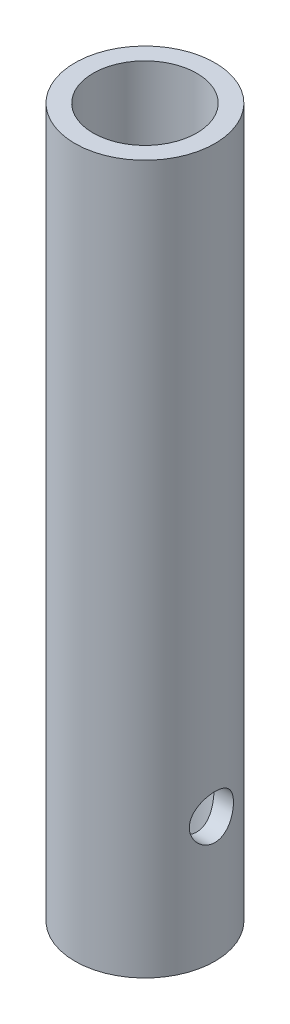
ISO-10303-21;
HEADER;
FILE_DESCRIPTION(('STEP AP214'),'2;1');
FILE_NAME('part.step','',(''),(''),'','','');
FILE_SCHEMA(('AUTOMOTIVE_DESIGN { 1 0 10303 214 1 1 1 1 }'));
ENDSEC;
DATA;
#1=APPLICATION_CONTEXT('core data for automotive mechanical design processes');
#2=APPLICATION_PROTOCOL_DEFINITION('international standard','automotive_design',2000,#1);
#3=PRODUCT_CONTEXT('',#1,'mechanical');
#4=PRODUCT('Part','Part','',(#3));
#5=PRODUCT_RELATED_PRODUCT_CATEGORY('part','',(#4));
#6=PRODUCT_DEFINITION_FORMATION('','',#4);
#7=PRODUCT_DEFINITION_CONTEXT('part definition',#1,'design');
#8=PRODUCT_DEFINITION('design','',#6,#7);
#9=PRODUCT_DEFINITION_SHAPE('','',#8);
#10=(LENGTH_UNIT() NAMED_UNIT(*) SI_UNIT(.MILLI.,.METRE.));
#11=(NAMED_UNIT(*) PLANE_ANGLE_UNIT() SI_UNIT($,.RADIAN.));
#12=(NAMED_UNIT(*) SI_UNIT($,.STERADIAN.) SOLID_ANGLE_UNIT());
#13=UNCERTAINTY_MEASURE_WITH_UNIT(LENGTH_MEASURE(1.E-05),#10,'distance_accuracy_value','');
#14=(GEOMETRIC_REPRESENTATION_CONTEXT(3) GLOBAL_UNCERTAINTY_ASSIGNED_CONTEXT((#13)) GLOBAL_UNIT_ASSIGNED_CONTEXT((#10,
#11,#12)) REPRESENTATION_CONTEXT('',''));
#15=CARTESIAN_POINT('',(0.,0.,0.));
#16=DIRECTION('',(0.,0.,1.));
#17=DIRECTION('',(1.,0.,0.));
#18=AXIS2_PLACEMENT_3D('',#15,#16,#17);
#19=CARTESIAN_POINT('',(0.,0.,0.));
#20=DIRECTION('',(0.,1.,0.));
#21=DIRECTION('',(0.,0.,1.));
#22=AXIS2_PLACEMENT_3D('',#19,#20,#21);
#23=CYLINDRICAL_SURFACE('',#22,7.8994);
#24=CARTESIAN_POINT('',(0.,0.,0.));
#25=DIRECTION('',(0.,1.,0.));
#26=DIRECTION('',(0.,0.,1.));
#27=AXIS2_PLACEMENT_3D('',#24,#25,#26);
#28=CIRCLE('',#27,7.8994);
#29=CARTESIAN_POINT('',(0.,0.,7.8994));
#30=VERTEX_POINT('',#29);
#31=EDGE_CURVE('E19',#30,#30,#28,.F.);
#32=ORIENTED_EDGE('',*,*,#31,.T.);
#33=EDGE_LOOP('',(#32));
#34=FACE_BOUND('',#33,.T.);
#35=CARTESIAN_POINT('',(-7.8994,22.4155,0.));
#36=CARTESIAN_POINT('',(-7.89940011957743,22.4154999827047,-0.0900909455322913));
#37=CARTESIAN_POINT('',(-7.89785405918172,22.4118773055462,-0.18017480955821));
#38=CARTESIAN_POINT('',(-7.89172006441946,22.3974393928908,-0.359668175483565));
#39=CARTESIAN_POINT('',(-7.8871311880012,22.3866219298947,-0.449077459861129));
#40=CARTESIAN_POINT('',(-7.86893898909967,22.3434807683766,-0.715447382265416));
#41=CARTESIAN_POINT('',(-7.85091017366673,22.3004683593117,-0.890507757900065));
#42=CARTESIAN_POINT('',(-7.80497358874915,22.1878785451905,-1.22972446439531));
#43=CARTESIAN_POINT('',(-7.77709541376198,22.1183806726597,-1.39391172987598));
#44=CARTESIAN_POINT('',(-7.71415573800613,21.9551561194063,-1.7082196654322));
#45=CARTESIAN_POINT('',(-7.67909404732079,21.8614287980923,-1.85833996345455));
#46=CARTESIAN_POINT('',(-7.60324607737454,21.6472882242244,-2.14818119977289));
#47=CARTESIAN_POINT('',(-7.56226719848583,21.5258204238047,-2.28707162310963));
#48=CARTESIAN_POINT('',(-7.48001713677034,21.2618866456998,-2.54322479099802));
#49=CARTESIAN_POINT('',(-7.43874582344902,21.1194106473977,-2.66047715407025));
#50=CARTESIAN_POINT('',(-7.35817131459704,20.8085248447807,-2.87607060011641));
#51=CARTESIAN_POINT('',(-7.31908214860351,20.6391515782758,-2.97311080006257));
#52=CARTESIAN_POINT('',(-7.25037876962843,20.2845819632871,-3.13695384268311));
#53=CARTESIAN_POINT('',(-7.22075956737812,20.0993940121837,-3.20377261529476));
#54=CARTESIAN_POINT('',(-7.17644951066472,19.7280323662106,-3.30179855313361));
#55=CARTESIAN_POINT('',(-7.16108968647077,19.5423654059996,-3.3346110332703));
#56=CARTESIAN_POINT('',(-7.14512389683299,19.1675745505665,-3.36869668037104));
#57=CARTESIAN_POINT('',(-7.14450926828347,18.9784527505063,-3.36998836645753));
#58=CARTESIAN_POINT('',(-7.1575398852456,18.6184544591925,-3.34220073448649));
#59=CARTESIAN_POINT('',(-7.1700363269348,18.4473389936287,-3.31556827842629));
#60=CARTESIAN_POINT('',(-7.20593216702921,18.1122877685588,-3.23680619897807));
#61=CARTESIAN_POINT('',(-7.22933377293387,17.9483534700685,-3.18467141312419));
#62=CARTESIAN_POINT('',(-7.28493810098623,17.6280813383806,-3.05536018529139));
#63=CARTESIAN_POINT('',(-7.31732105731012,17.4719860530579,-2.97766410048811));
#64=CARTESIAN_POINT('',(-7.38720166797959,17.174426223117,-2.79980012240537));
#65=CARTESIAN_POINT('',(-7.42470120702866,17.0329671036787,-2.69962393972994));
#66=CARTESIAN_POINT('',(-7.50462715784337,16.7555070069029,-2.46925811712774));
#67=CARTESIAN_POINT('',(-7.54719568761193,16.6211006561839,-2.33719542824727));
#68=CARTESIAN_POINT('',(-7.62970256372789,16.3757120957385,-2.05186379483344));
#69=CARTESIAN_POINT('',(-7.66963954222732,16.2647420028327,-1.8985839482413));
#70=CARTESIAN_POINT('',(-7.72488036303643,16.117085655614,-1.65349697741047));
#71=CARTESIAN_POINT('',(-7.74271552972851,16.0705257287443,-1.56806397981707));
#72=CARTESIAN_POINT('',(-7.77609177912493,15.9848353370123,-1.39313529857647));
#73=CARTESIAN_POINT('',(-7.79163384868043,15.9457016741155,-1.3036413843839));
#74=CARTESIAN_POINT('',(-7.81994917557215,15.8753012654081,-1.12134458010026));
#75=CARTESIAN_POINT('',(-7.83272652359614,15.8440228857325,-1.02854681862546));
#76=CARTESIAN_POINT('',(-7.85515496188783,15.7896098912859,-0.840264552251529));
#77=CARTESIAN_POINT('',(-7.8648073561828,15.7664718792308,-0.744781186167356));
#78=CARTESIAN_POINT('',(-7.88151711521063,15.7266364341266,-0.541860401906331));
#79=CARTESIAN_POINT('',(-7.88820140809138,15.7108561199374,-0.434210434745033));
#80=CARTESIAN_POINT('',(-7.89714273263952,15.6897880005224,-0.217703516123923));
#81=CARTESIAN_POINT('',(-7.89939985552826,15.6844999791041,-0.108846589579858));
#82=CARTESIAN_POINT('',(-7.89940011957743,15.6845000172953,0.0900909455322901));
#83=CARTESIAN_POINT('',(-7.89785405918172,15.6881226944538,0.180174809558209));
#84=CARTESIAN_POINT('',(-7.89172006441946,15.7025606071092,0.359668175483564));
#85=CARTESIAN_POINT('',(-7.8871311880012,15.7133780701053,0.449077459861127));
#86=CARTESIAN_POINT('',(-7.86893898909967,15.7565192316234,0.715447382265414));
#87=CARTESIAN_POINT('',(-7.85091017366673,15.7995316406883,0.890507757900063));
#88=CARTESIAN_POINT('',(-7.80497358874915,15.9121214548095,1.22972446439531));
#89=CARTESIAN_POINT('',(-7.77709541376198,15.9816193273403,1.39391172987598));
#90=CARTESIAN_POINT('',(-7.71415573800613,16.1448438805936,1.7082196654322));
#91=CARTESIAN_POINT('',(-7.67909404732079,16.2385712019077,1.85833996345455));
#92=CARTESIAN_POINT('',(-7.60324607737454,16.4527117757756,2.14818119977289));
#93=CARTESIAN_POINT('',(-7.56226719848583,16.5741795761953,2.28707162310963));
#94=CARTESIAN_POINT('',(-7.48001713677034,16.8381133543002,2.54322479099801));
#95=CARTESIAN_POINT('',(-7.43874582344902,16.9805893526023,2.66047715407025));
#96=CARTESIAN_POINT('',(-7.35817131459705,17.2914751552193,2.87607060011641));
#97=CARTESIAN_POINT('',(-7.31908214860351,17.4608484217242,2.97311080006256));
#98=CARTESIAN_POINT('',(-7.25037876962843,17.8154180367129,3.1369538426831));
#99=CARTESIAN_POINT('',(-7.22075956737812,18.0006059878163,3.20377261529476));
#100=CARTESIAN_POINT('',(-7.17644951066472,18.3719676337894,3.30179855313361));
#101=CARTESIAN_POINT('',(-7.16108968647076,18.5576345940004,3.3346110332703));
#102=CARTESIAN_POINT('',(-7.14512389683299,18.9324254494335,3.36869668037104));
#103=CARTESIAN_POINT('',(-7.14450926828347,19.1215472494937,3.36998836645753));
#104=CARTESIAN_POINT('',(-7.1575398852456,19.4815455408075,3.34220073448649));
#105=CARTESIAN_POINT('',(-7.1700363269348,19.6526610063713,3.31556827842629));
#106=CARTESIAN_POINT('',(-7.2059321670292,19.9877122314412,3.23680619897807));
#107=CARTESIAN_POINT('',(-7.22933377293387,20.1516465299315,3.18467141312419));
#108=CARTESIAN_POINT('',(-7.28493810098623,20.4719186616194,3.05536018529139));
#109=CARTESIAN_POINT('',(-7.31732105731012,20.6280139469421,2.97766410048812));
#110=CARTESIAN_POINT('',(-7.38720166797959,20.925573776883,2.79980012240538));
#111=CARTESIAN_POINT('',(-7.42470120702866,21.0670328963213,2.69962393972994));
#112=CARTESIAN_POINT('',(-7.50462715784337,21.3444929930971,2.46925811712775));
#113=CARTESIAN_POINT('',(-7.54719568761193,21.4788993438161,2.33719542824727));
#114=CARTESIAN_POINT('',(-7.62970256372789,21.7242879042615,2.05186379483345));
#115=CARTESIAN_POINT('',(-7.66963954222732,21.8352579971673,1.8985839482413));
#116=CARTESIAN_POINT('',(-7.72488036303643,21.982914344386,1.65349697741047));
#117=CARTESIAN_POINT('',(-7.74271552972851,22.0294742712557,1.56806397981708));
#118=CARTESIAN_POINT('',(-7.77609177912493,22.1151646629876,1.39313529857647));
#119=CARTESIAN_POINT('',(-7.79163384868043,22.1542983258845,1.30364138438391));
#120=CARTESIAN_POINT('',(-7.81994917557215,22.2246987345919,1.12134458010026));
#121=CARTESIAN_POINT('',(-7.83272652359614,22.2559771142675,1.02854681862546));
#122=CARTESIAN_POINT('',(-7.85515496188783,22.3103901087141,0.840264552251531));
#123=CARTESIAN_POINT('',(-7.8648073561828,22.3335281207692,0.744781186167358));
#124=CARTESIAN_POINT('',(-7.88151711521063,22.3733635658734,0.541860401906331));
#125=CARTESIAN_POINT('',(-7.88820140809138,22.3891438800626,0.434210434745033));
#126=CARTESIAN_POINT('',(-7.89714273263952,22.4102119994776,0.217703516123923));
#127=CARTESIAN_POINT('',(-7.89939985552826,22.4155000208959,0.108846589579857));
#128=CARTESIAN_POINT('',(-7.8994,22.4155,0.));
#129=B_SPLINE_CURVE_WITH_KNOTS('',3,(#35,#36,#37,#38,#39,#40,#41,#42,#43,#44,#45,#46,#47,#48,
#49,#50,#51,#52,#53,#54,#55,#56,#57,#58,#59,#60,#61,#62,#63,#64,#65,#66,#67,#68,#69,#70,#71,#72,
#73,#74,#75,#76,#77,#78,#79,#80,#81,#82,#83,#84,#85,#86,#87,#88,#89,#90,#91,#92,#93,#94,#95,#96,
#97,#98,#99,#100,#101,#102,#103,#104,#105,#106,#107,#108,#109,#110,#111,#112,#113,#114,#115,
#116,#117,#118,#119,#120,#121,#122,#123,#124,#125,#126,#127,#128),.UNSPECIFIED.,.T.,.F.,(4,2,2,
2,2,2,2,2,2,2,2,2,2,2,2,2,2,2,2,2,2,2,2,2,2,2,2,2,2,2,2,2,2,2,2,2,2,2,2,2,2,2,2,2,2,2,4),(0.,
0.27016458327695,0.540412848221202,1.0810346680645,1.62004569953803,2.15907098313887,
2.72365265244503,3.2885044957296,3.8827367347599,4.47665538350896,5.0410467131666,
5.60510644318493,6.12356550270688,6.64212955795063,7.17196440790796,7.70199495314163,
8.27899639295136,8.85629542292056,9.15272539024612,9.44902741230648,9.74488798108518,
10.0406249291434,10.3670406336038,10.6934496122332,10.9636141955102,11.2338624604544,
11.7744842802977,12.3134953117713,12.8525205953721,13.4171022646783,13.9819541079628,
14.5761863469931,15.1701049957422,15.7344963253998,16.2985560554182,16.8170151149401,
17.3355791701839,17.8654140201412,18.3954445653749,18.9724460051846,19.5497450351538,
19.8461750024794,20.1424770245397,20.4383375933184,20.7340745413766,21.060490245837,
21.3868992244665),.UNSPECIFIED.);
#130=CARTESIAN_POINT('',(-7.8994,22.4155,0.));
#131=VERTEX_POINT('',#130);
#132=EDGE_CURVE('E57',#131,#131,#129,.T.);
#133=ORIENTED_EDGE('',*,*,#132,.T.);
#134=EDGE_LOOP('',(#133));
#135=FACE_BOUND('',#134,.T.);
#136=CARTESIAN_POINT('',(0.,107.95,0.));
#137=DIRECTION('',(0.,1.,0.));
#138=DIRECTION('',(0.,0.,1.));
#139=AXIS2_PLACEMENT_3D('',#136,#137,#138);
#140=CIRCLE('',#139,7.8994);
#141=CARTESIAN_POINT('',(0.,107.95,7.8994));
#142=VERTEX_POINT('',#141);
#143=EDGE_CURVE('E62',#142,#142,#140,.F.);
#144=ORIENTED_EDGE('',*,*,#143,.F.);
#145=EDGE_LOOP('',(#144));
#146=FACE_BOUND('',#145,.T.);
#147=CARTESIAN_POINT('',(7.8994,15.6845,0.));
#148=CARTESIAN_POINT('',(7.89940011957743,15.6845000172953,-0.0900909455322899));
#149=CARTESIAN_POINT('',(7.89785405918172,15.6881226944538,-0.180174809558209));
#150=CARTESIAN_POINT('',(7.89172006441946,15.7025606071092,-0.359668175483564));
#151=CARTESIAN_POINT('',(7.8871311880012,15.7133780701053,-0.449077459861127));
#152=CARTESIAN_POINT('',(7.86893898909967,15.7565192316234,-0.715447382265414));
#153=CARTESIAN_POINT('',(7.85091017366673,15.7995316406883,-0.890507757900063));
#154=CARTESIAN_POINT('',(7.80497358874915,15.9121214548095,-1.22972446439531));
#155=CARTESIAN_POINT('',(7.77709541376198,15.9816193273403,-1.39391172987598));
#156=CARTESIAN_POINT('',(7.71415573800613,16.1448438805936,-1.7082196654322));
#157=CARTESIAN_POINT('',(7.67909404732079,16.2385712019077,-1.85833996345455));
#158=CARTESIAN_POINT('',(7.60324607737454,16.4527117757756,-2.14818119977289));
#159=CARTESIAN_POINT('',(7.56226719848583,16.5741795761953,-2.28707162310963));
#160=CARTESIAN_POINT('',(7.48001713677034,16.8381133543002,-2.54322479099801));
#161=CARTESIAN_POINT('',(7.43874582344902,16.9805893526023,-2.66047715407025));
#162=CARTESIAN_POINT('',(7.35817131459704,17.2914751552193,-2.87607060011641));
#163=CARTESIAN_POINT('',(7.31908214860351,17.4608484217242,-2.97311080006256));
#164=CARTESIAN_POINT('',(7.25037876962843,17.8154180367129,-3.1369538426831));
#165=CARTESIAN_POINT('',(7.22075956737812,18.0006059878163,-3.20377261529476));
#166=CARTESIAN_POINT('',(7.17644951066472,18.3719676337894,-3.30179855313361));
#167=CARTESIAN_POINT('',(7.16108968647077,18.5576345940004,-3.3346110332703));
#168=CARTESIAN_POINT('',(7.14512389683299,18.9324254494335,-3.36869668037104));
#169=CARTESIAN_POINT('',(7.14450926828347,19.1215472494937,-3.36998836645753));
#170=CARTESIAN_POINT('',(7.1575398852456,19.4815455408075,-3.34220073448649));
#171=CARTESIAN_POINT('',(7.1700363269348,19.6526610063713,-3.31556827842629));
#172=CARTESIAN_POINT('',(7.2059321670292,19.9877122314412,-3.23680619897807));
#173=CARTESIAN_POINT('',(7.22933377293387,20.1516465299315,-3.18467141312419));
#174=CARTESIAN_POINT('',(7.28493810098623,20.4719186616194,-3.05536018529139));
#175=CARTESIAN_POINT('',(7.31732105731012,20.6280139469421,-2.97766410048812));
#176=CARTESIAN_POINT('',(7.38720166797959,20.925573776883,-2.79980012240538));
#177=CARTESIAN_POINT('',(7.42470120702866,21.0670328963213,-2.69962393972994));
#178=CARTESIAN_POINT('',(7.50462715784337,21.3444929930971,-2.46925811712775));
#179=CARTESIAN_POINT('',(7.54719568761193,21.4788993438161,-2.33719542824727));
#180=CARTESIAN_POINT('',(7.62970256372789,21.7242879042615,-2.05186379483345));
#181=CARTESIAN_POINT('',(7.66963954222732,21.8352579971673,-1.8985839482413));
#182=CARTESIAN_POINT('',(7.72488036303642,21.982914344386,-1.65349697741048));
#183=CARTESIAN_POINT('',(7.74271552972851,22.0294742712557,-1.56806397981708));
#184=CARTESIAN_POINT('',(7.77609177912492,22.1151646629876,-1.39313529857648));
#185=CARTESIAN_POINT('',(7.79163384868043,22.1542983258845,-1.30364138438391));
#186=CARTESIAN_POINT('',(7.81994917557215,22.2246987345919,-1.12134458010027));
#187=CARTESIAN_POINT('',(7.83272652359613,22.2559771142675,-1.02854681862546));
#188=CARTESIAN_POINT('',(7.85515496188783,22.3103901087141,-0.840264552251532));
#189=CARTESIAN_POINT('',(7.8648073561828,22.3335281207692,-0.744781186167358));
#190=CARTESIAN_POINT('',(7.88151711521063,22.3733635658734,-0.541860401906331));
#191=CARTESIAN_POINT('',(7.88820140809138,22.3891438800626,-0.434210434745033));
#192=CARTESIAN_POINT('',(7.89714273263952,22.4102119994776,-0.217703516123923));
#193=CARTESIAN_POINT('',(7.89939985552826,22.4155000208959,-0.108846589579858));
#194=CARTESIAN_POINT('',(7.89940011957743,22.4154999827047,0.0900909455322906));
#195=CARTESIAN_POINT('',(7.89785405918172,22.4118773055462,0.18017480955821));
#196=CARTESIAN_POINT('',(7.89172006441946,22.3974393928908,0.359668175483565));
#197=CARTESIAN_POINT('',(7.8871311880012,22.3866219298947,0.449077459861128));
#198=CARTESIAN_POINT('',(7.86893898909967,22.3434807683766,0.715447382265415));
#199=CARTESIAN_POINT('',(7.85091017366673,22.3004683593117,0.890507757900064));
#200=CARTESIAN_POINT('',(7.80497358874915,22.1878785451905,1.22972446439531));
#201=CARTESIAN_POINT('',(7.77709541376198,22.1183806726597,1.39391172987598));
#202=CARTESIAN_POINT('',(7.71415573800613,21.9551561194063,1.7082196654322));
#203=CARTESIAN_POINT('',(7.67909404732079,21.8614287980923,1.85833996345455));
#204=CARTESIAN_POINT('',(7.60324607737454,21.6472882242244,2.14818119977289));
#205=CARTESIAN_POINT('',(7.56226719848583,21.5258204238047,2.28707162310963));
#206=CARTESIAN_POINT('',(7.48001713677034,21.2618866456998,2.54322479099801));
#207=CARTESIAN_POINT('',(7.43874582344902,21.1194106473977,2.66047715407025));
#208=CARTESIAN_POINT('',(7.35817131459704,20.8085248447807,2.87607060011641));
#209=CARTESIAN_POINT('',(7.31908214860351,20.6391515782758,2.97311080006257));
#210=CARTESIAN_POINT('',(7.25037876962843,20.2845819632871,3.13695384268311));
#211=CARTESIAN_POINT('',(7.22075956737812,20.0993940121837,3.20377261529476));
#212=CARTESIAN_POINT('',(7.17644951066472,19.7280323662106,3.30179855313361));
#213=CARTESIAN_POINT('',(7.16108968647077,19.5423654059996,3.3346110332703));
#214=CARTESIAN_POINT('',(7.14512389683299,19.1675745505665,3.36869668037104));
#215=CARTESIAN_POINT('',(7.14450926828347,18.9784527505063,3.36998836645753));
#216=CARTESIAN_POINT('',(7.1575398852456,18.6184544591925,3.34220073448649));
#217=CARTESIAN_POINT('',(7.1700363269348,18.4473389936287,3.31556827842629));
#218=CARTESIAN_POINT('',(7.2059321670292,18.1122877685588,3.23680619897807));
#219=CARTESIAN_POINT('',(7.22933377293387,17.9483534700685,3.18467141312419));
#220=CARTESIAN_POINT('',(7.28493810098623,17.6280813383806,3.05536018529139));
#221=CARTESIAN_POINT('',(7.31732105731012,17.4719860530579,2.97766410048812));
#222=CARTESIAN_POINT('',(7.38720166797959,17.174426223117,2.79980012240538));
#223=CARTESIAN_POINT('',(7.42470120702866,17.0329671036787,2.69962393972994));
#224=CARTESIAN_POINT('',(7.50462715784337,16.7555070069029,2.46925811712775));
#225=CARTESIAN_POINT('',(7.54719568761193,16.6211006561839,2.33719542824727));
#226=CARTESIAN_POINT('',(7.62970256372789,16.3757120957385,2.05186379483345));
#227=CARTESIAN_POINT('',(7.66963954222732,16.2647420028327,1.8985839482413));
#228=CARTESIAN_POINT('',(7.72488036303643,16.117085655614,1.65349697741047));
#229=CARTESIAN_POINT('',(7.74271552972851,16.0705257287443,1.56806397981708));
#230=CARTESIAN_POINT('',(7.77609177912493,15.9848353370123,1.39313529857647));
#231=CARTESIAN_POINT('',(7.79163384868043,15.9457016741155,1.30364138438391));
#232=CARTESIAN_POINT('',(7.81994917557215,15.8753012654081,1.12134458010026));
#233=CARTESIAN_POINT('',(7.83272652359614,15.8440228857325,1.02854681862546));
#234=CARTESIAN_POINT('',(7.85515496188783,15.7896098912859,0.840264552251531));
#235=CARTESIAN_POINT('',(7.8648073561828,15.7664718792308,0.744781186167358));
#236=CARTESIAN_POINT('',(7.88151711521063,15.7266364341266,0.541860401906332));
#237=CARTESIAN_POINT('',(7.88820140809138,15.7108561199374,0.434210434745034));
#238=CARTESIAN_POINT('',(7.89714273263952,15.6897880005224,0.217703516123924));
#239=CARTESIAN_POINT('',(7.89939985552826,15.6844999791041,0.108846589579859));
#240=CARTESIAN_POINT('',(7.8994,15.6845,0.));
#241=B_SPLINE_CURVE_WITH_KNOTS('',3,(#147,#148,#149,#150,#151,#152,#153,#154,#155,#156,#157,
#158,#159,#160,#161,#162,#163,#164,#165,#166,#167,#168,#169,#170,#171,#172,#173,#174,#175,#176,
#177,#178,#179,#180,#181,#182,#183,#184,#185,#186,#187,#188,#189,#190,#191,#192,#193,#194,#195,
#196,#197,#198,#199,#200,#201,#202,#203,#204,#205,#206,#207,#208,#209,#210,#211,#212,#213,#214,
#215,#216,#217,#218,#219,#220,#221,#222,#223,#224,#225,#226,#227,#228,#229,#230,#231,#232,#233,
#234,#235,#236,#237,#238,#239,#240),.UNSPECIFIED.,.T.,.F.,(4,2,2,2,2,2,2,2,2,2,2,2,2,2,2,2,2,2,
2,2,2,2,2,2,2,2,2,2,2,2,2,2,2,2,2,2,2,2,2,2,2,2,2,2,2,2,4),(0.,0.27016458327695,
0.540412848221202,1.08103466806449,1.62004569953803,2.15907098313887,2.72365265244503,
3.2885044957296,3.8827367347599,4.47665538350895,5.04104671316661,5.60510644318493,
6.12356550270688,6.64212955795063,7.17196440790796,7.70199495314163,8.27899639295135,
8.85629542292055,9.15272539024611,9.44902741230647,9.74488798108518,10.0406249291434,
10.3670406336038,10.6934496122332,10.9636141955102,11.2338624604544,11.7744842802977,
12.3134953117713,12.8525205953721,13.4171022646783,13.9819541079628,14.5761863469931,
15.1701049957422,15.7344963253998,16.2985560554182,16.8170151149401,17.3355791701839,
17.8654140201412,18.3954445653749,18.9724460051846,19.5497450351538,19.8461750024794,
20.1424770245397,20.4383375933184,20.7340745413766,21.060490245837,21.3868992244665),.UNSPECIFIED.);
#242=CARTESIAN_POINT('',(7.8994,15.6845,0.));
#243=VERTEX_POINT('',#242);
#244=EDGE_CURVE('E64',#243,#243,#241,.T.);
#245=ORIENTED_EDGE('',*,*,#244,.T.);
#246=EDGE_LOOP('',(#245));
#247=FACE_BOUND('',#246,.T.);
#248=ADVANCED_FACE('F15',(#34,#135,#146,#247),#23,.F.);
#249=CARTESIAN_POINT('',(0.,0.,0.));
#250=DIRECTION('',(0.,1.,0.));
#251=DIRECTION('',(0.,0.,1.));
#252=AXIS2_PLACEMENT_3D('',#249,#250,#251);
#253=PLANE('',#252);
#254=ORIENTED_EDGE('',*,*,#31,.F.);
#255=EDGE_LOOP('',(#254));
#256=FACE_BOUND('',#255,.T.);
#257=CARTESIAN_POINT('',(0.,0.,0.));
#258=DIRECTION('',(0.,1.,0.));
#259=DIRECTION('',(0.,0.,1.));
#260=AXIS2_PLACEMENT_3D('',#257,#258,#259);
#261=CIRCLE('',#260,10.668);
#262=CARTESIAN_POINT('',(0.,0.,10.668));
#263=VERTEX_POINT('',#262);
#264=EDGE_CURVE('E48',#263,#263,#261,.T.);
#265=ORIENTED_EDGE('',*,*,#264,.F.);
#266=EDGE_LOOP('',(#265));
#267=FACE_BOUND('',#266,.T.);
#268=ADVANCED_FACE('F54',(#256,#267),#253,.F.);
#269=CARTESIAN_POINT('',(-19.6215,19.05,0.));
#270=DIRECTION('',(1.,0.,0.));
#271=DIRECTION('',(0.,0.,-1.));
#272=AXIS2_PLACEMENT_3D('',#269,#270,#271);
#273=CYLINDRICAL_SURFACE('',#272,3.3655);
#274=ORIENTED_EDGE('',*,*,#132,.F.);
#275=EDGE_LOOP('',(#274));
#276=FACE_BOUND('',#275,.T.);
#277=CARTESIAN_POINT('',(-10.668,15.6845,0.));
#278=CARTESIAN_POINT('',(-10.6679921057425,15.6845119158497,-0.183926121580241));
#279=CARTESIAN_POINT('',(-10.6631910174389,15.6996482572292,-0.368056152593494));
#280=CARTESIAN_POINT('',(-10.6444774435834,15.7597041756387,-0.731107714751057));
#281=CARTESIAN_POINT('',(-10.6305493099017,15.8046749047514,-0.910019748499456));
#282=CARTESIAN_POINT('',(-10.5951097799122,15.9227221051207,-1.25707331407684));
#283=CARTESIAN_POINT('',(-10.5736148014162,15.9957377581957,-1.42523724011533));
#284=CARTESIAN_POINT('',(-10.5252621164468,16.1675904299865,-1.74687385390943));
#285=CARTESIAN_POINT('',(-10.4984052260993,16.2664235197866,-1.90034877219685));
#286=CARTESIAN_POINT('',(-10.4412242052262,16.4903982426374,-2.19316241721947));
#287=CARTESIAN_POINT('',(-10.4108231844346,16.616208201376,-2.33197491946115));
#288=CARTESIAN_POINT('',(-10.3504215558463,16.8891483795274,-2.58692870398734));
#289=CARTESIAN_POINT('',(-10.3204210476434,17.0362837978468,-2.70306444168043));
#290=CARTESIAN_POINT('',(-10.2633955104267,17.3522499624487,-2.91221835934602));
#291=CARTESIAN_POINT('',(-10.2364647101141,17.521534614499,-3.00457896661032));
#292=CARTESIAN_POINT('',(-10.1897801599705,17.8742197451723,-3.1593010233561));
#293=CARTESIAN_POINT('',(-10.1700244390136,18.0576163301851,-3.22167071342013));
#294=CARTESIAN_POINT('',(-10.1407280464658,18.4274019338041,-3.31271757128969));
#295=CARTESIAN_POINT('',(-10.1308931070784,18.613527365407,-3.34236794599024));
#296=CARTESIAN_POINT('',(-10.1216785855929,18.9883509741217,-3.3701752249988));
#297=CARTESIAN_POINT('',(-10.1222961670391,19.177048439384,-3.36834067323404));
#298=CARTESIAN_POINT('',(-10.1336573943969,19.5435740359018,-3.33399060735986));
#299=CARTESIAN_POINT('',(-10.1439911655296,19.7215334010154,-3.30271691306156));
#300=CARTESIAN_POINT('',(-10.1729539713108,20.0695386355117,-3.21239140297137));
#301=CARTESIAN_POINT('',(-10.1915839451656,20.2395836065042,-3.15333644204216));
#302=CARTESIAN_POINT('',(-10.235351618194,20.5698754824187,-3.00825424144797));
#303=CARTESIAN_POINT('',(-10.2605818491726,20.7299393862886,-2.92183948464403));
#304=CARTESIAN_POINT('',(-10.3146634173577,21.0336903412361,-2.72476818969533));
#305=CARTESIAN_POINT('',(-10.3435155051336,21.1773739859669,-2.61410662324974));
#306=CARTESIAN_POINT('',(-10.4032266220933,21.4512917011746,-2.36561389362909));
#307=CARTESIAN_POINT('',(-10.4341167301539,21.5805953419981,-2.22676219125206));
#308=CARTESIAN_POINT('',(-10.4932577657267,21.8143520900257,-1.92894385246517));
#309=CARTESIAN_POINT('',(-10.5215075479207,21.9187944430313,-1.76996855661282));
#310=CARTESIAN_POINT('',(-10.5725000662629,22.1005487343677,-1.43436268492009));
#311=CARTESIAN_POINT('',(-10.5951922601758,22.1776143553755,-1.25758931957615));
#312=CARTESIAN_POINT('',(-10.6228923656308,22.2697874970008,-0.984292444846808));
#313=CARTESIAN_POINT('',(-10.6310672261741,22.2966011940062,-0.891878619477666));
#314=CARTESIAN_POINT('',(-10.6450946244541,22.3422464174473,-0.704941010195153));
#315=CARTESIAN_POINT('',(-10.6509482108652,22.3610815485961,-0.610418199483802));
#316=CARTESIAN_POINT('',(-10.6596681857814,22.3890190926256,-0.430075028798219));
#317=CARTESIAN_POINT('',(-10.6627851984232,22.3989407271545,-0.344392660388608));
#318=CARTESIAN_POINT('',(-10.6669529595005,22.4121839837468,-0.172488481459492));
#319=CARTESIAN_POINT('',(-10.668003702635,22.4155055888781,-0.086266669556635));
#320=CARTESIAN_POINT('',(-10.6679921057425,22.4154880841503,0.183926121580238));
#321=CARTESIAN_POINT('',(-10.6631910174389,22.4003517427708,0.368056152593492));
#322=CARTESIAN_POINT('',(-10.6444774435834,22.3402958243612,0.731107714751055));
#323=CARTESIAN_POINT('',(-10.6305493099017,22.2953250952486,0.910019748499453));
#324=CARTESIAN_POINT('',(-10.5951097799122,22.1772778948793,1.25707331407684));
#325=CARTESIAN_POINT('',(-10.5736148014162,22.1042622418043,1.42523724011533));
#326=CARTESIAN_POINT('',(-10.5252621164468,21.9324095700135,1.74687385390943));
#327=CARTESIAN_POINT('',(-10.4984052260993,21.8335764802134,1.90034877219685));
#328=CARTESIAN_POINT('',(-10.4412242052262,21.6096017573626,2.19316241721947));
#329=CARTESIAN_POINT('',(-10.4108231844346,21.483791798624,2.33197491946114));
#330=CARTESIAN_POINT('',(-10.3504215558463,21.2108516204726,2.58692870398733));
#331=CARTESIAN_POINT('',(-10.3204210476434,21.0637162021532,2.70306444168043));
#332=CARTESIAN_POINT('',(-10.2633955104267,20.7477500375513,2.91221835934602));
#333=CARTESIAN_POINT('',(-10.2364647101141,20.578465385501,3.00457896661032));
#334=CARTESIAN_POINT('',(-10.1897801599705,20.2257802548277,3.15930102335609));
#335=CARTESIAN_POINT('',(-10.1700244390136,20.0423836698149,3.22167071342013));
#336=CARTESIAN_POINT('',(-10.1407280464658,19.6725980661959,3.31271757128969));
#337=CARTESIAN_POINT('',(-10.1308931070784,19.486472634593,3.34236794599024));
#338=CARTESIAN_POINT('',(-10.1216785855929,19.1116490258783,3.3701752249988));
#339=CARTESIAN_POINT('',(-10.1222961670391,18.922951560616,3.36834067323404));
#340=CARTESIAN_POINT('',(-10.1336573943969,18.5564259640982,3.33399060735986));
#341=CARTESIAN_POINT('',(-10.1439911655296,18.3784665989846,3.30271691306156));
#342=CARTESIAN_POINT('',(-10.1729539713108,18.0304613644883,3.21239140297137));
#343=CARTESIAN_POINT('',(-10.1915839451656,17.8604163934958,3.15333644204216));
#344=CARTESIAN_POINT('',(-10.235351618194,17.5301245175813,3.00825424144798));
#345=CARTESIAN_POINT('',(-10.2605818491726,17.3700606137114,2.92183948464403));
#346=CARTESIAN_POINT('',(-10.3146634173577,17.0663096587639,2.72476818969533));
#347=CARTESIAN_POINT('',(-10.3435155051336,16.922626014033,2.61410662324974));
#348=CARTESIAN_POINT('',(-10.4032266220933,16.6487082988254,2.3656138936291));
#349=CARTESIAN_POINT('',(-10.4341167301539,16.5194046580019,2.22676219125206));
#350=CARTESIAN_POINT('',(-10.4932577657267,16.2856479099743,1.92894385246518));
#351=CARTESIAN_POINT('',(-10.5215075479207,16.1812055569687,1.76996855661283));
#352=CARTESIAN_POINT('',(-10.5725000662629,15.9994512656323,1.4343626849201));
#353=CARTESIAN_POINT('',(-10.5951922601758,15.9223856446245,1.25758931957616));
#354=CARTESIAN_POINT('',(-10.6228923656308,15.8302125029992,0.984292444846812));
#355=CARTESIAN_POINT('',(-10.6310672261741,15.8033988059938,0.89187861947767));
#356=CARTESIAN_POINT('',(-10.6450946244541,15.7577535825527,0.704941010195157));
#357=CARTESIAN_POINT('',(-10.6509482108652,15.7389184514039,0.610418199483806));
#358=CARTESIAN_POINT('',(-10.6596681857814,15.7109809073744,0.430075028798221));
#359=CARTESIAN_POINT('',(-10.6627851984232,15.7010592728455,0.344392660388608));
#360=CARTESIAN_POINT('',(-10.6669529595005,15.6878160162532,0.17248848145949));
#361=CARTESIAN_POINT('',(-10.668003702635,15.6844944111219,0.086266669556633));
#362=CARTESIAN_POINT('',(-10.668,15.6845,0.));
#363=B_SPLINE_CURVE_WITH_KNOTS('',3,(#277,#278,#279,#280,#281,#282,#283,#284,#285,#286,#287,
#288,#289,#290,#291,#292,#293,#294,#295,#296,#297,#298,#299,#300,#301,#302,#303,#304,#305,#306,
#307,#308,#309,#310,#311,#312,#313,#314,#315,#316,#317,#318,#319,#320,#321,#322,#323,#324,#325,
#326,#327,#328,#329,#330,#331,#332,#333,#334,#335,#336,#337,#338,#339,#340,#341,#342,#343,#344,
#345,#346,#347,#348,#349,#350,#351,#352,#353,#354,#355,#356,#357,#358,#359,#360,#361,#362),
.UNSPECIFIED.,.T.,.F.,(4,2,2,2,2,2,2,2,2,2,2,2,2,2,2,2,2,2,2,2,2,2,2,2,2,2,2,2,2,2,2,2,2,2,2,2,
2,2,2,2,2,2,4),(0.,0.551459867052895,1.10386768300412,1.65508425077395,2.20621698283974,
2.77302526833983,3.33997196846366,3.92123036736962,4.50232896293546,5.06563395551535,
5.62878608889307,6.16919939527447,6.70967389696644,7.25817448245776,7.80678892378449,
8.3807980858213,8.95505509648976,9.53435529287586,9.82375789272114,10.1130296007594,
10.3716795612486,10.630330185293,11.1817900523459,11.7341978682972,12.285414436067,
12.8365471681328,13.4033554536329,13.9703021537567,14.5515605526627,15.1326591482285,
15.6959641408084,16.2591162741861,16.7995295805675,17.3400040822595,17.8885046677508,
18.4371191090775,19.0111282711143,19.5853852817828,20.1646854781689,20.4540880780142,
20.7433597860525,21.0020097465417,21.2606603705861),.UNSPECIFIED.);
#364=CARTESIAN_POINT('',(-10.668,15.6845,0.));
#365=VERTEX_POINT('',#364);
#366=EDGE_CURVE('E28',#365,#365,#363,.T.);
#367=ORIENTED_EDGE('',*,*,#366,.F.);
#368=EDGE_LOOP('',(#367));
#369=FACE_BOUND('',#368,.T.);
#370=ADVANCED_FACE('F50',(#276,#369),#273,.F.);
#371=CARTESIAN_POINT('',(0.,107.95,0.));
#372=DIRECTION('',(0.,1.,0.));
#373=DIRECTION('',(0.,0.,1.));
#374=AXIS2_PLACEMENT_3D('',#371,#372,#373);
#375=PLANE('',#374);
#376=ORIENTED_EDGE('',*,*,#143,.T.);
#377=EDGE_LOOP('',(#376));
#378=FACE_BOUND('',#377,.T.);
#379=CARTESIAN_POINT('',(0.,107.95,0.));
#380=DIRECTION('',(0.,1.,0.));
#381=DIRECTION('',(0.,0.,1.));
#382=AXIS2_PLACEMENT_3D('',#379,#380,#381);
#383=CIRCLE('',#382,10.668);
#384=CARTESIAN_POINT('',(0.,107.95,10.668));
#385=VERTEX_POINT('',#384);
#386=EDGE_CURVE('E23',#385,#385,#383,.F.);
#387=ORIENTED_EDGE('',*,*,#386,.F.);
#388=EDGE_LOOP('',(#387));
#389=FACE_BOUND('',#388,.T.);
#390=ADVANCED_FACE('F53',(#378,#389),#375,.T.);
#391=CARTESIAN_POINT('',(-19.6215,19.05,0.));
#392=DIRECTION('',(1.,0.,0.));
#393=DIRECTION('',(0.,0.,-1.));
#394=AXIS2_PLACEMENT_3D('',#391,#392,#393);
#395=CYLINDRICAL_SURFACE('',#394,3.3655);
#396=ORIENTED_EDGE('',*,*,#244,.F.);
#397=EDGE_LOOP('',(#396));
#398=FACE_BOUND('',#397,.T.);
#399=CARTESIAN_POINT('',(10.668,22.4155,0.));
#400=CARTESIAN_POINT('',(10.6679921057425,22.4154880841503,-0.18392612158024));
#401=CARTESIAN_POINT('',(10.6631910174389,22.4003517427708,-0.368056152593493));
#402=CARTESIAN_POINT('',(10.6444774435834,22.3402958243613,-0.731107714751057));
#403=CARTESIAN_POINT('',(10.6305493099017,22.2953250952486,-0.910019748499455));
#404=CARTESIAN_POINT('',(10.5951097799122,22.1772778948793,-1.25707331407684));
#405=CARTESIAN_POINT('',(10.5736148014162,22.1042622418043,-1.42523724011533));
#406=CARTESIAN_POINT('',(10.5252621164468,21.9324095700135,-1.74687385390943));
#407=CARTESIAN_POINT('',(10.4984052260993,21.8335764802134,-1.90034877219685));
#408=CARTESIAN_POINT('',(10.4412242052262,21.6096017573626,-2.19316241721947));
#409=CARTESIAN_POINT('',(10.4108231844346,21.483791798624,-2.33197491946115));
#410=CARTESIAN_POINT('',(10.3504215558463,21.2108516204726,-2.58692870398734));
#411=CARTESIAN_POINT('',(10.3204210476434,21.0637162021532,-2.70306444168043));
#412=CARTESIAN_POINT('',(10.2633955104267,20.7477500375513,-2.91221835934602));
#413=CARTESIAN_POINT('',(10.2364647101141,20.578465385501,-3.00457896661032));
#414=CARTESIAN_POINT('',(10.1897801599705,20.2257802548277,-3.15930102335609));
#415=CARTESIAN_POINT('',(10.1700244390136,20.0423836698149,-3.22167071342013));
#416=CARTESIAN_POINT('',(10.1407280464658,19.6725980661959,-3.31271757128969));
#417=CARTESIAN_POINT('',(10.1308931070784,19.486472634593,-3.34236794599024));
#418=CARTESIAN_POINT('',(10.1216785855929,19.1116490258783,-3.3701752249988));
#419=CARTESIAN_POINT('',(10.1222961670391,18.9229515606159,-3.36834067323404));
#420=CARTESIAN_POINT('',(10.1336573943969,18.5564259640982,-3.33399060735986));
#421=CARTESIAN_POINT('',(10.1439911655296,18.3784665989846,-3.30271691306156));
#422=CARTESIAN_POINT('',(10.1729539713108,18.0304613644883,-3.21239140297137));
#423=CARTESIAN_POINT('',(10.1915839451656,17.8604163934958,-3.15333644204216));
#424=CARTESIAN_POINT('',(10.235351618194,17.5301245175813,-3.00825424144797));
#425=CARTESIAN_POINT('',(10.2605818491726,17.3700606137114,-2.92183948464403));
#426=CARTESIAN_POINT('',(10.3146634173577,17.0663096587639,-2.72476818969533));
#427=CARTESIAN_POINT('',(10.3435155051336,16.922626014033,-2.61410662324974));
#428=CARTESIAN_POINT('',(10.4032266220933,16.6487082988254,-2.36561389362909));
#429=CARTESIAN_POINT('',(10.4341167301539,16.5194046580019,-2.22676219125206));
#430=CARTESIAN_POINT('',(10.4932577657267,16.2856479099743,-1.92894385246517));
#431=CARTESIAN_POINT('',(10.5215075479207,16.1812055569687,-1.76996855661282));
#432=CARTESIAN_POINT('',(10.5725000662629,15.9994512656323,-1.43436268492009));
#433=CARTESIAN_POINT('',(10.5951922601758,15.9223856446245,-1.25758931957615));
#434=CARTESIAN_POINT('',(10.6228923656308,15.8302125029992,-0.984292444846808));
#435=CARTESIAN_POINT('',(10.6310672261741,15.8033988059938,-0.891878619477667));
#436=CARTESIAN_POINT('',(10.6450946244541,15.7577535825527,-0.704941010195153));
#437=CARTESIAN_POINT('',(10.6509482108652,15.7389184514039,-0.610418199483802));
#438=CARTESIAN_POINT('',(10.6596681857814,15.7109809073744,-0.430075028798218));
#439=CARTESIAN_POINT('',(10.6627851984232,15.7010592728455,-0.344392660388607));
#440=CARTESIAN_POINT('',(10.6669529595005,15.6878160162532,-0.17248848145949));
#441=CARTESIAN_POINT('',(10.668003702635,15.6844944111219,-0.086266669556633));
#442=CARTESIAN_POINT('',(10.6679921057425,15.6845119158497,0.18392612158024));
#443=CARTESIAN_POINT('',(10.6631910174389,15.6996482572292,0.368056152593494));
#444=CARTESIAN_POINT('',(10.6444774435834,15.7597041756387,0.731107714751057));
#445=CARTESIAN_POINT('',(10.6305493099017,15.8046749047514,0.910019748499456));
#446=CARTESIAN_POINT('',(10.5951097799122,15.9227221051207,1.25707331407684));
#447=CARTESIAN_POINT('',(10.5736148014162,15.9957377581957,1.42523724011533));
#448=CARTESIAN_POINT('',(10.5252621164468,16.1675904299865,1.74687385390943));
#449=CARTESIAN_POINT('',(10.4984052260993,16.2664235197866,1.90034877219685));
#450=CARTESIAN_POINT('',(10.4412242052262,16.4903982426374,2.19316241721947));
#451=CARTESIAN_POINT('',(10.4108231844346,16.616208201376,2.33197491946114));
#452=CARTESIAN_POINT('',(10.3504215558463,16.8891483795274,2.58692870398734));
#453=CARTESIAN_POINT('',(10.3204210476434,17.0362837978468,2.70306444168043));
#454=CARTESIAN_POINT('',(10.2633955104267,17.3522499624487,2.91221835934602));
#455=CARTESIAN_POINT('',(10.2364647101141,17.521534614499,3.00457896661032));
#456=CARTESIAN_POINT('',(10.1897801599705,17.8742197451723,3.1593010233561));
#457=CARTESIAN_POINT('',(10.1700244390136,18.0576163301851,3.22167071342013));
#458=CARTESIAN_POINT('',(10.1407280464658,18.4274019338041,3.31271757128969));
#459=CARTESIAN_POINT('',(10.1308931070784,18.613527365407,3.34236794599024));
#460=CARTESIAN_POINT('',(10.1216785855929,18.9883509741217,3.3701752249988));
#461=CARTESIAN_POINT('',(10.1222961670391,19.177048439384,3.36834067323404));
#462=CARTESIAN_POINT('',(10.1336573943969,19.5435740359018,3.33399060735986));
#463=CARTESIAN_POINT('',(10.1439911655296,19.7215334010154,3.30271691306156));
#464=CARTESIAN_POINT('',(10.1729539713108,20.0695386355117,3.21239140297137));
#465=CARTESIAN_POINT('',(10.1915839451656,20.2395836065042,3.15333644204216));
#466=CARTESIAN_POINT('',(10.235351618194,20.5698754824187,3.00825424144797));
#467=CARTESIAN_POINT('',(10.2605818491726,20.7299393862886,2.92183948464403));
#468=CARTESIAN_POINT('',(10.3146634173577,21.0336903412361,2.72476818969534));
#469=CARTESIAN_POINT('',(10.3435155051336,21.1773739859669,2.61410662324974));
#470=CARTESIAN_POINT('',(10.4032266220933,21.4512917011746,2.36561389362909));
#471=CARTESIAN_POINT('',(10.4341167301539,21.5805953419981,2.22676219125206));
#472=CARTESIAN_POINT('',(10.4932577657267,21.8143520900257,1.92894385246517));
#473=CARTESIAN_POINT('',(10.5215075479207,21.9187944430313,1.76996855661282));
#474=CARTESIAN_POINT('',(10.5725000662629,22.1005487343677,1.43436268492009));
#475=CARTESIAN_POINT('',(10.5951922601758,22.1776143553755,1.25758931957615));
#476=CARTESIAN_POINT('',(10.6228923656308,22.2697874970008,0.984292444846806));
#477=CARTESIAN_POINT('',(10.6310672261741,22.2966011940062,0.891878619477665));
#478=CARTESIAN_POINT('',(10.6450946244541,22.3422464174473,0.704941010195152));
#479=CARTESIAN_POINT('',(10.6509482108652,22.3610815485961,0.610418199483801));
#480=CARTESIAN_POINT('',(10.6596681857814,22.3890190926256,0.430075028798218));
#481=CARTESIAN_POINT('',(10.6627851984232,22.3989407271545,0.344392660388607));
#482=CARTESIAN_POINT('',(10.6669529595005,22.4121839837468,0.17248848145949));
#483=CARTESIAN_POINT('',(10.668003702635,22.4155055888781,0.0862666695566336));
#484=CARTESIAN_POINT('',(10.668,22.4155,0.));
#485=B_SPLINE_CURVE_WITH_KNOTS('',3,(#399,#400,#401,#402,#403,#404,#405,#406,#407,#408,#409,
#410,#411,#412,#413,#414,#415,#416,#417,#418,#419,#420,#421,#422,#423,#424,#425,#426,#427,#428,
#429,#430,#431,#432,#433,#434,#435,#436,#437,#438,#439,#440,#441,#442,#443,#444,#445,#446,#447,
#448,#449,#450,#451,#452,#453,#454,#455,#456,#457,#458,#459,#460,#461,#462,#463,#464,#465,#466,
#467,#468,#469,#470,#471,#472,#473,#474,#475,#476,#477,#478,#479,#480,#481,#482,#483,#484),
.UNSPECIFIED.,.T.,.F.,(4,2,2,2,2,2,2,2,2,2,2,2,2,2,2,2,2,2,2,2,2,2,2,2,2,2,2,2,2,2,2,2,2,2,2,2,
2,2,2,2,2,2,4),(0.,0.551459867052895,1.10386768300412,1.65508425077396,2.20621698283975,
2.77302526833983,3.33997196846366,3.92123036736961,4.50232896293547,5.06563395551536,
5.62878608889307,6.16919939527447,6.70967389696645,7.25817448245776,7.80678892378449,
8.3807980858213,8.95505509648976,9.53435529287586,9.82375789272114,10.1130296007594,
10.3716795612486,10.630330185293,11.1817900523459,11.7341978682972,12.285414436067,
12.8365471681328,13.4033554536329,13.9703021537567,14.5515605526627,15.1326591482285,
15.6959641408084,16.2591162741861,16.7995295805675,17.3400040822595,17.8885046677508,
18.4371191090775,19.0111282711143,19.5853852817828,20.1646854781689,20.4540880780142,
20.7433597860525,21.0020097465417,21.2606603705861),.UNSPECIFIED.);
#486=CARTESIAN_POINT('',(10.668,22.4155,0.));
#487=VERTEX_POINT('',#486);
#488=EDGE_CURVE('E10',#487,#487,#485,.T.);
#489=ORIENTED_EDGE('',*,*,#488,.F.);
#490=EDGE_LOOP('',(#489));
#491=FACE_BOUND('',#490,.T.);
#492=ADVANCED_FACE('F35',(#398,#491),#395,.F.);
#493=CARTESIAN_POINT('',(0.,0.,0.));
#494=DIRECTION('',(0.,1.,0.));
#495=DIRECTION('',(0.,0.,1.));
#496=AXIS2_PLACEMENT_3D('',#493,#494,#495);
#497=CYLINDRICAL_SURFACE('',#496,10.668);
#498=ORIENTED_EDGE('',*,*,#264,.T.);
#499=EDGE_LOOP('',(#498));
#500=FACE_BOUND('',#499,.T.);
#501=ORIENTED_EDGE('',*,*,#366,.T.);
#502=EDGE_LOOP('',(#501));
#503=FACE_BOUND('',#502,.T.);
#504=ORIENTED_EDGE('',*,*,#386,.T.);
#505=EDGE_LOOP('',(#504));
#506=FACE_BOUND('',#505,.T.);
#507=ORIENTED_EDGE('',*,*,#488,.T.);
#508=EDGE_LOOP('',(#507));
#509=FACE_BOUND('',#508,.T.);
#510=ADVANCED_FACE('F38',(#500,#503,#506,#509),#497,.T.);
#511=CLOSED_SHELL('',(#248,#268,#370,#390,#492,#510));
#512=MANIFOLD_SOLID_BREP('B1',#511);
#513=ADVANCED_BREP_SHAPE_REPRESENTATION('',(#18,#512),#14);
#514=SHAPE_DEFINITION_REPRESENTATION(#9,#513);
ENDSEC;
END-ISO-10303-21;
